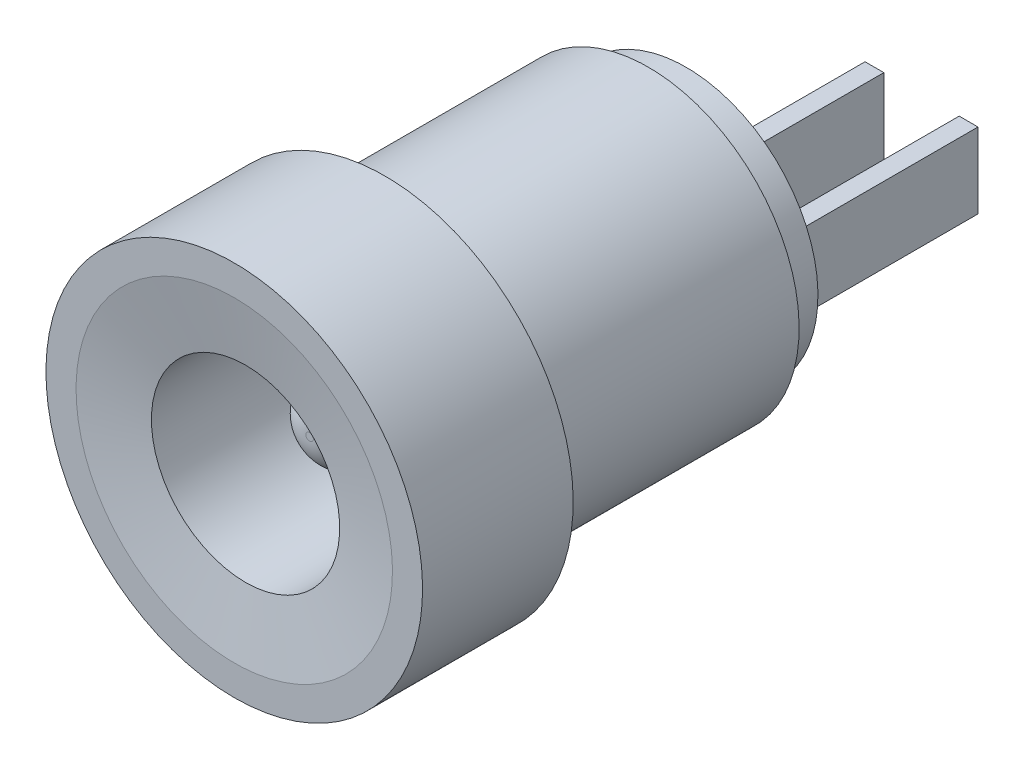
ISO-10303-21;
HEADER;
FILE_DESCRIPTION(('STEP AP214'),'2;1');
FILE_NAME('part.step','',(''),(''),'','','');
FILE_SCHEMA(('AUTOMOTIVE_DESIGN { 1 0 10303 214 1 1 1 1 }'));
ENDSEC;
DATA;
#1=APPLICATION_CONTEXT('core data for automotive mechanical design processes');
#2=APPLICATION_PROTOCOL_DEFINITION('international standard','automotive_design',2000,#1);
#3=PRODUCT_CONTEXT('',#1,'mechanical');
#4=PRODUCT('Part','Part','',(#3));
#5=PRODUCT_RELATED_PRODUCT_CATEGORY('part','',(#4));
#6=PRODUCT_DEFINITION_FORMATION('','',#4);
#7=PRODUCT_DEFINITION_CONTEXT('part definition',#1,'design');
#8=PRODUCT_DEFINITION('design','',#6,#7);
#9=PRODUCT_DEFINITION_SHAPE('','',#8);
#10=(LENGTH_UNIT() NAMED_UNIT(*) SI_UNIT(.MILLI.,.METRE.));
#11=(NAMED_UNIT(*) PLANE_ANGLE_UNIT() SI_UNIT($,.RADIAN.));
#12=(NAMED_UNIT(*) SI_UNIT($,.STERADIAN.) SOLID_ANGLE_UNIT());
#13=UNCERTAINTY_MEASURE_WITH_UNIT(LENGTH_MEASURE(1.E-05),#10,'distance_accuracy_value','');
#14=(GEOMETRIC_REPRESENTATION_CONTEXT(3) GLOBAL_UNCERTAINTY_ASSIGNED_CONTEXT((#13)) GLOBAL_UNIT_ASSIGNED_CONTEXT((#10,
#11,#12)) REPRESENTATION_CONTEXT('',''));
#15=CARTESIAN_POINT('',(0.,0.,0.));
#16=DIRECTION('',(0.,0.,1.));
#17=DIRECTION('',(1.,0.,0.));
#18=AXIS2_PLACEMENT_3D('',#15,#16,#17);
#19=CARTESIAN_POINT('',(0.,0.,-12.));
#20=DIRECTION('',(0.,0.,1.));
#21=DIRECTION('',(0.,-1.,0.));
#22=AXIS2_PLACEMENT_3D('',#19,#20,#21);
#23=PLANE('',#22);
#24=DIRECTION('',(0.,-1.,0.));
#25=VECTOR('',#24,1.);
#26=CARTESIAN_POINT('',(2.75,1.,-12.));
#27=LINE('',#26,#25);
#28=CARTESIAN_POINT('',(2.75,1.,-12.));
#29=VERTEX_POINT('',#28);
#30=CARTESIAN_POINT('',(2.75,-1.,-12.));
#31=VERTEX_POINT('',#30);
#32=EDGE_CURVE('E125',#29,#31,#27,.T.);
#33=ORIENTED_EDGE('',*,*,#32,.F.);
#34=DIRECTION('',(1.,0.,0.));
#35=VECTOR('',#34,1.);
#36=CARTESIAN_POINT('',(2.75,1.,-12.));
#37=LINE('',#36,#35);
#38=CARTESIAN_POINT('',(2.25,1.,-12.));
#39=VERTEX_POINT('',#38);
#40=EDGE_CURVE('E138',#39,#29,#37,.T.);
#41=ORIENTED_EDGE('',*,*,#40,.F.);
#42=DIRECTION('',(0.,1.,0.));
#43=VECTOR('',#42,1.);
#44=CARTESIAN_POINT('',(2.25,1.,-12.));
#45=LINE('',#44,#43);
#46=CARTESIAN_POINT('',(2.25,-1.,-12.));
#47=VERTEX_POINT('',#46);
#48=EDGE_CURVE('E147',#47,#39,#45,.T.);
#49=ORIENTED_EDGE('',*,*,#48,.F.);
#50=DIRECTION('',(-1.,0.,0.));
#51=VECTOR('',#50,1.);
#52=CARTESIAN_POINT('',(2.75,-1.,-12.));
#53=LINE('',#52,#51);
#54=EDGE_CURVE('E128',#31,#47,#53,.T.);
#55=ORIENTED_EDGE('',*,*,#54,.F.);
#56=EDGE_LOOP('',(#33,#41,#49,#55));
#57=FACE_BOUND('',#56,.T.);
#58=CARTESIAN_POINT('',(0.,0.,-12.));
#59=DIRECTION('',(0.,0.,1.));
#60=DIRECTION('',(0.,-1.,0.));
#61=AXIS2_PLACEMENT_3D('',#58,#59,#60);
#62=CIRCLE('',#61,3.5);
#63=CARTESIAN_POINT('',(0.,-3.5,-12.));
#64=VERTEX_POINT('',#63);
#65=EDGE_CURVE('E187',#64,#64,#62,.T.);
#66=ORIENTED_EDGE('',*,*,#65,.F.);
#67=EDGE_LOOP('',(#66));
#68=FACE_BOUND('',#67,.T.);
#69=DIRECTION('',(0.,-1.,0.));
#70=VECTOR('',#69,1.);
#71=CARTESIAN_POINT('',(0.25,1.,-12.));
#72=LINE('',#71,#70);
#73=CARTESIAN_POINT('',(0.25,1.,-12.));
#74=VERTEX_POINT('',#73);
#75=CARTESIAN_POINT('',(0.25,-1.,-12.));
#76=VERTEX_POINT('',#75);
#77=EDGE_CURVE('E124',#74,#76,#72,.T.);
#78=ORIENTED_EDGE('',*,*,#77,.F.);
#79=DIRECTION('',(1.,0.,0.));
#80=VECTOR('',#79,1.);
#81=CARTESIAN_POINT('',(0.25,1.,-12.));
#82=LINE('',#81,#80);
#83=CARTESIAN_POINT('',(-0.25,1.,-12.));
#84=VERTEX_POINT('',#83);
#85=EDGE_CURVE('E121',#84,#74,#82,.T.);
#86=ORIENTED_EDGE('',*,*,#85,.F.);
#87=DIRECTION('',(0.,1.,0.));
#88=VECTOR('',#87,1.);
#89=CARTESIAN_POINT('',(-0.25,1.,-12.));
#90=LINE('',#89,#88);
#91=CARTESIAN_POINT('',(-0.25,-1.,-12.));
#92=VERTEX_POINT('',#91);
#93=EDGE_CURVE('E59',#92,#84,#90,.T.);
#94=ORIENTED_EDGE('',*,*,#93,.F.);
#95=DIRECTION('',(-1.,0.,0.));
#96=VECTOR('',#95,1.);
#97=CARTESIAN_POINT('',(0.25,-1.,-12.));
#98=LINE('',#97,#96);
#99=EDGE_CURVE('E54',#76,#92,#98,.T.);
#100=ORIENTED_EDGE('',*,*,#99,.F.);
#101=EDGE_LOOP('',(#78,#86,#94,#100));
#102=FACE_BOUND('',#101,.T.);
#103=ADVANCED_FACE('F39',(#57,#68,#102),#23,.F.);
#104=CARTESIAN_POINT('',(0.,0.,-3.));
#105=DIRECTION('',(0.,0.,-1.));
#106=DIRECTION('',(0.,1.,0.));
#107=AXIS2_PLACEMENT_3D('',#104,#105,#106);
#108=DEGENERATE_TOROIDAL_SURFACE('',#107,0.1,1.,.T.);
#109=CARTESIAN_POINT('',(0.,0.,-3.));
#110=DIRECTION('',(0.,0.,-1.));
#111=DIRECTION('',(0.,1.,0.));
#112=AXIS2_PLACEMENT_3D('',#109,#110,#111);
#113=CIRCLE('',#112,1.1);
#114=CARTESIAN_POINT('',(0.,1.1,-3.));
#115=VERTEX_POINT('',#114);
#116=EDGE_CURVE('E191',#115,#115,#113,.T.);
#117=ORIENTED_EDGE('',*,*,#116,.F.);
#118=EDGE_LOOP('',(#117));
#119=FACE_BOUND('',#118,.T.);
#120=CARTESIAN_POINT('',(0.,0.,-2.));
#121=DIRECTION('',(0.,0.,-1.));
#122=DIRECTION('',(0.,1.,0.));
#123=AXIS2_PLACEMENT_3D('',#120,#121,#122);
#124=CIRCLE('',#123,0.1);
#125=CARTESIAN_POINT('',(0.,0.1,-2.));
#126=VERTEX_POINT('',#125);
#127=EDGE_CURVE('E194',#126,#126,#124,.F.);
#128=ORIENTED_EDGE('',*,*,#127,.F.);
#129=EDGE_LOOP('',(#128));
#130=FACE_BOUND('',#129,.T.);
#131=ADVANCED_FACE('F218',(#119,#130),#108,.T.);
#132=CARTESIAN_POINT('',(0.,0.,23.6977848270715));
#133=DIRECTION('',(0.,0.,1.));
#134=DIRECTION('',(0.,-1.,0.));
#135=AXIS2_PLACEMENT_3D('',#132,#133,#134);
#136=CYLINDRICAL_SURFACE('',#135,3.5);
#137=CARTESIAN_POINT('',(0.,0.,-11.));
#138=DIRECTION('',(0.,0.,1.));
#139=DIRECTION('',(0.,-1.,0.));
#140=AXIS2_PLACEMENT_3D('',#137,#138,#139);
#141=CIRCLE('',#140,3.5);
#142=CARTESIAN_POINT('',(0.,-3.5,-11.));
#143=VERTEX_POINT('',#142);
#144=EDGE_CURVE('E183',#143,#143,#141,.T.);
#145=ORIENTED_EDGE('',*,*,#144,.F.);
#146=EDGE_LOOP('',(#145));
#147=FACE_BOUND('',#146,.T.);
#148=ORIENTED_EDGE('',*,*,#65,.T.);
#149=EDGE_LOOP('',(#148));
#150=FACE_BOUND('',#149,.T.);
#151=ADVANCED_FACE('F224',(#147,#150),#136,.T.);
#152=CARTESIAN_POINT('',(0.,3.5,-11.));
#153=DIRECTION('',(0.,0.,1.));
#154=DIRECTION('',(0.,-1.,0.));
#155=AXIS2_PLACEMENT_3D('',#152,#153,#154);
#156=PLANE('',#155);
#157=CARTESIAN_POINT('',(0.,0.,-11.));
#158=DIRECTION('',(0.,0.,1.));
#159=DIRECTION('',(0.,-1.,0.));
#160=AXIS2_PLACEMENT_3D('',#157,#158,#159);
#161=CIRCLE('',#160,4.);
#162=CARTESIAN_POINT('',(0.,-4.,-11.));
#163=VERTEX_POINT('',#162);
#164=EDGE_CURVE('E179',#163,#163,#161,.T.);
#165=ORIENTED_EDGE('',*,*,#164,.F.);
#166=EDGE_LOOP('',(#165));
#167=FACE_BOUND('',#166,.T.);
#168=ORIENTED_EDGE('',*,*,#144,.T.);
#169=EDGE_LOOP('',(#168));
#170=FACE_BOUND('',#169,.T.);
#171=ADVANCED_FACE('F230',(#167,#170),#156,.F.);
#172=CARTESIAN_POINT('',(0.,0.,23.6977848270715));
#173=DIRECTION('',(0.,0.,1.));
#174=DIRECTION('',(0.,-1.,0.));
#175=AXIS2_PLACEMENT_3D('',#172,#173,#174);
#176=CYLINDRICAL_SURFACE('',#175,4.);
#177=CARTESIAN_POINT('',(0.,0.,-4.));
#178=DIRECTION('',(0.,0.,1.));
#179=DIRECTION('',(0.,-1.,0.));
#180=AXIS2_PLACEMENT_3D('',#177,#178,#179);
#181=CIRCLE('',#180,4.);
#182=CARTESIAN_POINT('',(0.,-4.,-4.));
#183=VERTEX_POINT('',#182);
#184=EDGE_CURVE('E176',#183,#183,#181,.T.);
#185=ORIENTED_EDGE('',*,*,#184,.F.);
#186=EDGE_LOOP('',(#185));
#187=FACE_BOUND('',#186,.T.);
#188=ORIENTED_EDGE('',*,*,#164,.T.);
#189=EDGE_LOOP('',(#188));
#190=FACE_BOUND('',#189,.T.);
#191=ADVANCED_FACE('F234',(#187,#190),#176,.T.);
#192=CARTESIAN_POINT('',(0.,4.,-4.));
#193=DIRECTION('',(0.,0.,1.));
#194=DIRECTION('',(0.,-1.,0.));
#195=AXIS2_PLACEMENT_3D('',#192,#193,#194);
#196=PLANE('',#195);
#197=CARTESIAN_POINT('',(0.,0.,-4.));
#198=DIRECTION('',(0.,0.,1.));
#199=DIRECTION('',(0.,-1.,0.));
#200=AXIS2_PLACEMENT_3D('',#197,#198,#199);
#201=CIRCLE('',#200,5.);
#202=CARTESIAN_POINT('',(0.,-5.,-4.));
#203=VERTEX_POINT('',#202);
#204=EDGE_CURVE('E173',#203,#203,#201,.T.);
#205=ORIENTED_EDGE('',*,*,#204,.F.);
#206=EDGE_LOOP('',(#205));
#207=FACE_BOUND('',#206,.T.);
#208=ORIENTED_EDGE('',*,*,#184,.T.);
#209=EDGE_LOOP('',(#208));
#210=FACE_BOUND('',#209,.T.);
#211=ADVANCED_FACE('F238',(#207,#210),#196,.F.);
#212=CARTESIAN_POINT('',(0.,0.,23.6977848270715));
#213=DIRECTION('',(0.,0.,1.));
#214=DIRECTION('',(0.,-1.,0.));
#215=AXIS2_PLACEMENT_3D('',#212,#213,#214);
#216=CYLINDRICAL_SURFACE('',#215,5.);
#217=CARTESIAN_POINT('',(0.,0.,0.));
#218=DIRECTION('',(0.,0.,1.));
#219=DIRECTION('',(0.,-1.,0.));
#220=AXIS2_PLACEMENT_3D('',#217,#218,#219);
#221=CIRCLE('',#220,5.);
#222=CARTESIAN_POINT('',(0.,-5.,0.));
#223=VERTEX_POINT('',#222);
#224=EDGE_CURVE('E170',#223,#223,#221,.T.);
#225=ORIENTED_EDGE('',*,*,#224,.F.);
#226=EDGE_LOOP('',(#225));
#227=FACE_BOUND('',#226,.T.);
#228=ORIENTED_EDGE('',*,*,#204,.T.);
#229=EDGE_LOOP('',(#228));
#230=FACE_BOUND('',#229,.T.);
#231=ADVANCED_FACE('F242',(#227,#230),#216,.T.);
#232=CARTESIAN_POINT('',(0.,5.,0.));
#233=DIRECTION('',(0.,0.,-1.));
#234=DIRECTION('',(0.,1.,0.));
#235=AXIS2_PLACEMENT_3D('',#232,#233,#234);
#236=PLANE('',#235);
#237=CARTESIAN_POINT('',(0.,0.,0.));
#238=DIRECTION('',(0.,0.,-1.));
#239=DIRECTION('',(0.,1.,0.));
#240=AXIS2_PLACEMENT_3D('',#237,#238,#239);
#241=CIRCLE('',#240,4.20138454588531);
#242=CARTESIAN_POINT('',(0.,4.20138454588531,0.));
#243=VERTEX_POINT('',#242);
#244=EDGE_CURVE('E11',#243,#243,#241,.T.);
#245=ORIENTED_EDGE('',*,*,#244,.T.);
#246=EDGE_LOOP('',(#245));
#247=FACE_BOUND('',#246,.T.);
#248=ORIENTED_EDGE('',*,*,#224,.T.);
#249=EDGE_LOOP('',(#248));
#250=FACE_BOUND('',#249,.T.);
#251=ADVANCED_FACE('F246',(#247,#250),#236,.F.);
#252=CARTESIAN_POINT('',(0.,0.,23.6977848270715));
#253=DIRECTION('',(0.,0.,1.));
#254=DIRECTION('',(0.,-1.,0.));
#255=AXIS2_PLACEMENT_3D('',#252,#253,#254);
#256=CYLINDRICAL_SURFACE('',#255,2.5);
#257=CARTESIAN_POINT('',(0.,0.,-0.300000000000002));
#258=DIRECTION('',(0.,0.,-1.));
#259=DIRECTION('',(0.,1.,0.));
#260=AXIS2_PLACEMENT_3D('',#257,#258,#259);
#261=CIRCLE('',#260,2.5);
#262=CARTESIAN_POINT('',(0.,2.5,-0.300000000000002));
#263=VERTEX_POINT('',#262);
#264=EDGE_CURVE('E47',#263,#263,#261,.F.);
#265=ORIENTED_EDGE('',*,*,#264,.T.);
#266=EDGE_LOOP('',(#265));
#267=FACE_BOUND('',#266,.T.);
#268=CARTESIAN_POINT('',(0.,0.,-8.));
#269=DIRECTION('',(0.,0.,1.));
#270=DIRECTION('',(0.,-1.,0.));
#271=AXIS2_PLACEMENT_3D('',#268,#269,#270);
#272=CIRCLE('',#271,2.5);
#273=CARTESIAN_POINT('',(0.,-2.5,-8.));
#274=VERTEX_POINT('',#273);
#275=EDGE_CURVE('E166',#274,#274,#272,.T.);
#276=ORIENTED_EDGE('',*,*,#275,.F.);
#277=EDGE_LOOP('',(#276));
#278=FACE_BOUND('',#277,.T.);
#279=ADVANCED_FACE('F199',(#267,#278),#256,.F.);
#280=CARTESIAN_POINT('',(0.,2.5,-8.));
#281=DIRECTION('',(0.,0.,-1.));
#282=DIRECTION('',(0.,1.,0.));
#283=AXIS2_PLACEMENT_3D('',#280,#281,#282);
#284=PLANE('',#283);
#285=CARTESIAN_POINT('',(0.,0.,-8.));
#286=DIRECTION('',(0.,0.,1.));
#287=DIRECTION('',(0.,-1.,0.));
#288=AXIS2_PLACEMENT_3D('',#285,#286,#287);
#289=CIRCLE('',#288,1.1);
#290=CARTESIAN_POINT('',(0.,-1.1,-8.));
#291=VERTEX_POINT('',#290);
#292=EDGE_CURVE('E163',#291,#291,#289,.T.);
#293=ORIENTED_EDGE('',*,*,#292,.F.);
#294=EDGE_LOOP('',(#293));
#295=FACE_BOUND('',#294,.T.);
#296=ORIENTED_EDGE('',*,*,#275,.T.);
#297=EDGE_LOOP('',(#296));
#298=FACE_BOUND('',#297,.T.);
#299=ADVANCED_FACE('F253',(#295,#298),#284,.F.);
#300=CARTESIAN_POINT('',(0.,0.,23.6977848270715));
#301=DIRECTION('',(0.,0.,1.));
#302=DIRECTION('',(0.,-1.,0.));
#303=AXIS2_PLACEMENT_3D('',#300,#301,#302);
#304=CYLINDRICAL_SURFACE('',#303,1.1);
#305=ORIENTED_EDGE('',*,*,#116,.T.);
#306=EDGE_LOOP('',(#305));
#307=FACE_BOUND('',#306,.T.);
#308=ORIENTED_EDGE('',*,*,#292,.T.);
#309=EDGE_LOOP('',(#308));
#310=FACE_BOUND('',#309,.T.);
#311=ADVANCED_FACE('F213',(#307,#310),#304,.T.);
#312=CARTESIAN_POINT('',(0.,1.1,-2.));
#313=DIRECTION('',(0.,0.,-1.));
#314=DIRECTION('',(0.,1.,0.));
#315=AXIS2_PLACEMENT_3D('',#312,#313,#314);
#316=PLANE('',#315);
#317=ORIENTED_EDGE('',*,*,#127,.T.);
#318=EDGE_LOOP('',(#317));
#319=FACE_BOUND('',#318,.T.);
#320=ADVANCED_FACE('F204',(#319),#316,.F.);
#321=CARTESIAN_POINT('',(0.,0.,-0.300000000000002));
#322=DIRECTION('',(0.,0.,1.));
#323=DIRECTION('',(0.,-1.,0.));
#324=AXIS2_PLACEMENT_3D('',#321,#322,#323);
#325=CONICAL_SURFACE('',#324,2.5,1.39626340159546);
#326=ORIENTED_EDGE('',*,*,#244,.F.);
#327=EDGE_LOOP('',(#326));
#328=FACE_BOUND('',#327,.T.);
#329=ORIENTED_EDGE('',*,*,#264,.F.);
#330=EDGE_LOOP('',(#329));
#331=FACE_BOUND('',#330,.T.);
#332=ADVANCED_FACE('F41',(#328,#331),#325,.F.);
#333=CARTESIAN_POINT('',(2.75,1.,-17.));
#334=DIRECTION('',(-1.,0.,0.));
#335=DIRECTION('',(0.,0.,1.));
#336=AXIS2_PLACEMENT_3D('',#333,#334,#335);
#337=PLANE('',#336);
#338=ORIENTED_EDGE('',*,*,#32,.T.);
#339=DIRECTION('',(0.,0.,1.));
#340=VECTOR('',#339,1.);
#341=CARTESIAN_POINT('',(2.75,-1.,-17.));
#342=LINE('',#341,#340);
#343=CARTESIAN_POINT('',(2.75,-1.,-17.));
#344=VERTEX_POINT('',#343);
#345=EDGE_CURVE('E160',#344,#31,#342,.T.);
#346=ORIENTED_EDGE('',*,*,#345,.F.);
#347=DIRECTION('',(0.,-1.,0.));
#348=VECTOR('',#347,1.);
#349=CARTESIAN_POINT('',(2.75,1.,-17.));
#350=LINE('',#349,#348);
#351=CARTESIAN_POINT('',(2.75,1.,-17.));
#352=VERTEX_POINT('',#351);
#353=EDGE_CURVE('E134',#352,#344,#350,.T.);
#354=ORIENTED_EDGE('',*,*,#353,.F.);
#355=DIRECTION('',(0.,0.,1.));
#356=VECTOR('',#355,1.);
#357=CARTESIAN_POINT('',(2.75,1.,-17.));
#358=LINE('',#357,#356);
#359=EDGE_CURVE('E143',#352,#29,#358,.T.);
#360=ORIENTED_EDGE('',*,*,#359,.T.);
#361=EDGE_LOOP('',(#338,#346,#354,#360));
#362=FACE_BOUND('',#361,.T.);
#363=ADVANCED_FACE('F203',(#362),#337,.F.);
#364=CARTESIAN_POINT('',(2.75,-1.,-17.));
#365=DIRECTION('',(0.,1.,0.));
#366=DIRECTION('',(0.,0.,1.));
#367=AXIS2_PLACEMENT_3D('',#364,#365,#366);
#368=PLANE('',#367);
#369=ORIENTED_EDGE('',*,*,#54,.T.);
#370=DIRECTION('',(0.,0.,1.));
#371=VECTOR('',#370,1.);
#372=CARTESIAN_POINT('',(2.25,-1.,-17.));
#373=LINE('',#372,#371);
#374=CARTESIAN_POINT('',(2.25,-1.,-17.));
#375=VERTEX_POINT('',#374);
#376=EDGE_CURVE('E157',#375,#47,#373,.T.);
#377=ORIENTED_EDGE('',*,*,#376,.F.);
#378=DIRECTION('',(-1.,0.,0.));
#379=VECTOR('',#378,1.);
#380=CARTESIAN_POINT('',(2.75,-1.,-17.));
#381=LINE('',#380,#379);
#382=EDGE_CURVE('E137',#344,#375,#381,.T.);
#383=ORIENTED_EDGE('',*,*,#382,.F.);
#384=ORIENTED_EDGE('',*,*,#345,.T.);
#385=EDGE_LOOP('',(#369,#377,#383,#384));
#386=FACE_BOUND('',#385,.T.);
#387=ADVANCED_FACE('F210',(#386),#368,.F.);
#388=CARTESIAN_POINT('',(2.25,1.,-17.));
#389=DIRECTION('',(1.,0.,0.));
#390=DIRECTION('',(0.,0.,-1.));
#391=AXIS2_PLACEMENT_3D('',#388,#389,#390);
#392=PLANE('',#391);
#393=ORIENTED_EDGE('',*,*,#48,.T.);
#394=DIRECTION('',(0.,0.,1.));
#395=VECTOR('',#394,1.);
#396=CARTESIAN_POINT('',(2.25,1.,-17.));
#397=LINE('',#396,#395);
#398=CARTESIAN_POINT('',(2.25,1.,-17.));
#399=VERTEX_POINT('',#398);
#400=EDGE_CURVE('E154',#399,#39,#397,.T.);
#401=ORIENTED_EDGE('',*,*,#400,.F.);
#402=DIRECTION('',(0.,1.,0.));
#403=VECTOR('',#402,1.);
#404=CARTESIAN_POINT('',(2.25,1.,-17.));
#405=LINE('',#404,#403);
#406=EDGE_CURVE('E140',#375,#399,#405,.T.);
#407=ORIENTED_EDGE('',*,*,#406,.F.);
#408=ORIENTED_EDGE('',*,*,#376,.T.);
#409=EDGE_LOOP('',(#393,#401,#407,#408));
#410=FACE_BOUND('',#409,.T.);
#411=ADVANCED_FACE('F262',(#410),#392,.F.);
#412=CARTESIAN_POINT('',(2.75,1.,-17.));
#413=DIRECTION('',(0.,-1.,0.));
#414=DIRECTION('',(0.,0.,-1.));
#415=AXIS2_PLACEMENT_3D('',#412,#413,#414);
#416=PLANE('',#415);
#417=ORIENTED_EDGE('',*,*,#40,.T.);
#418=ORIENTED_EDGE('',*,*,#359,.F.);
#419=DIRECTION('',(1.,0.,0.));
#420=VECTOR('',#419,1.);
#421=CARTESIAN_POINT('',(2.75,1.,-17.));
#422=LINE('',#421,#420);
#423=EDGE_CURVE('E142',#399,#352,#422,.T.);
#424=ORIENTED_EDGE('',*,*,#423,.F.);
#425=ORIENTED_EDGE('',*,*,#400,.T.);
#426=EDGE_LOOP('',(#417,#418,#424,#425));
#427=FACE_BOUND('',#426,.T.);
#428=ADVANCED_FACE('F266',(#427),#416,.F.);
#429=CARTESIAN_POINT('',(0.,0.,-17.));
#430=DIRECTION('',(0.,0.,-1.));
#431=DIRECTION('',(-1.,0.,0.));
#432=AXIS2_PLACEMENT_3D('',#429,#430,#431);
#433=PLANE('',#432);
#434=ORIENTED_EDGE('',*,*,#353,.T.);
#435=ORIENTED_EDGE('',*,*,#382,.T.);
#436=ORIENTED_EDGE('',*,*,#406,.T.);
#437=ORIENTED_EDGE('',*,*,#423,.T.);
#438=EDGE_LOOP('',(#434,#435,#436,#437));
#439=FACE_BOUND('',#438,.T.);
#440=ADVANCED_FACE('F270',(#439),#433,.T.);
#441=CARTESIAN_POINT('',(0.25,1.,-17.));
#442=DIRECTION('',(-1.,0.,0.));
#443=DIRECTION('',(0.,-1.,0.));
#444=AXIS2_PLACEMENT_3D('',#441,#442,#443);
#445=PLANE('',#444);
#446=ORIENTED_EDGE('',*,*,#77,.T.);
#447=DIRECTION('',(0.,0.,1.));
#448=VECTOR('',#447,1.);
#449=CARTESIAN_POINT('',(0.25,-1.,-17.));
#450=LINE('',#449,#448);
#451=CARTESIAN_POINT('',(0.25,-1.,-17.));
#452=VERTEX_POINT('',#451);
#453=EDGE_CURVE('E105',#452,#76,#450,.T.);
#454=ORIENTED_EDGE('',*,*,#453,.F.);
#455=DIRECTION('',(0.,-1.,0.));
#456=VECTOR('',#455,1.);
#457=CARTESIAN_POINT('',(0.25,1.,-17.));
#458=LINE('',#457,#456);
#459=CARTESIAN_POINT('',(0.25,1.,-17.));
#460=VERTEX_POINT('',#459);
#461=EDGE_CURVE('E112',#460,#452,#458,.T.);
#462=ORIENTED_EDGE('',*,*,#461,.F.);
#463=DIRECTION('',(0.,0.,1.));
#464=VECTOR('',#463,1.);
#465=CARTESIAN_POINT('',(0.25,1.,-17.));
#466=LINE('',#465,#464);
#467=EDGE_CURVE('E434',#460,#74,#466,.T.);
#468=ORIENTED_EDGE('',*,*,#467,.T.);
#469=EDGE_LOOP('',(#446,#454,#462,#468));
#470=FACE_BOUND('',#469,.T.);
#471=ADVANCED_FACE('F123',(#470),#445,.F.);
#472=CARTESIAN_POINT('',(0.25,-1.,-17.));
#473=DIRECTION('',(0.,1.,0.));
#474=DIRECTION('',(0.,0.,1.));
#475=AXIS2_PLACEMENT_3D('',#472,#473,#474);
#476=PLANE('',#475);
#477=ORIENTED_EDGE('',*,*,#99,.T.);
#478=DIRECTION('',(0.,0.,1.));
#479=VECTOR('',#478,1.);
#480=CARTESIAN_POINT('',(-0.25,-1.,-17.));
#481=LINE('',#480,#479);
#482=CARTESIAN_POINT('',(-0.25,-1.,-17.));
#483=VERTEX_POINT('',#482);
#484=EDGE_CURVE('E108',#483,#92,#481,.T.);
#485=ORIENTED_EDGE('',*,*,#484,.F.);
#486=DIRECTION('',(-1.,0.,0.));
#487=VECTOR('',#486,1.);
#488=CARTESIAN_POINT('',(0.25,-1.,-17.));
#489=LINE('',#488,#487);
#490=EDGE_CURVE('E101',#452,#483,#489,.T.);
#491=ORIENTED_EDGE('',*,*,#490,.F.);
#492=ORIENTED_EDGE('',*,*,#453,.T.);
#493=EDGE_LOOP('',(#477,#485,#491,#492));
#494=FACE_BOUND('',#493,.T.);
#495=ADVANCED_FACE('F103',(#494),#476,.F.);
#496=CARTESIAN_POINT('',(-0.25,1.,-17.));
#497=DIRECTION('',(1.,0.,0.));
#498=DIRECTION('',(0.,1.,0.));
#499=AXIS2_PLACEMENT_3D('',#496,#497,#498);
#500=PLANE('',#499);
#501=ORIENTED_EDGE('',*,*,#93,.T.);
#502=DIRECTION('',(0.,0.,1.));
#503=VECTOR('',#502,1.);
#504=CARTESIAN_POINT('',(-0.25,1.,-17.));
#505=LINE('',#504,#503);
#506=CARTESIAN_POINT('',(-0.25,1.,-17.));
#507=VERTEX_POINT('',#506);
#508=EDGE_CURVE('E130',#507,#84,#505,.T.);
#509=ORIENTED_EDGE('',*,*,#508,.F.);
#510=DIRECTION('',(0.,1.,0.));
#511=VECTOR('',#510,1.);
#512=CARTESIAN_POINT('',(-0.25,1.,-17.));
#513=LINE('',#512,#511);
#514=EDGE_CURVE('E111',#483,#507,#513,.T.);
#515=ORIENTED_EDGE('',*,*,#514,.F.);
#516=ORIENTED_EDGE('',*,*,#484,.T.);
#517=EDGE_LOOP('',(#501,#509,#515,#516));
#518=FACE_BOUND('',#517,.T.);
#519=ADVANCED_FACE('F279',(#518),#500,.F.);
#520=CARTESIAN_POINT('',(0.25,1.,-17.));
#521=DIRECTION('',(0.,-1.,0.));
#522=DIRECTION('',(0.,0.,-1.));
#523=AXIS2_PLACEMENT_3D('',#520,#521,#522);
#524=PLANE('',#523);
#525=ORIENTED_EDGE('',*,*,#85,.T.);
#526=ORIENTED_EDGE('',*,*,#467,.F.);
#527=DIRECTION('',(1.,0.,0.));
#528=VECTOR('',#527,1.);
#529=CARTESIAN_POINT('',(0.25,1.,-17.));
#530=LINE('',#529,#528);
#531=EDGE_CURVE('E117',#507,#460,#530,.T.);
#532=ORIENTED_EDGE('',*,*,#531,.F.);
#533=ORIENTED_EDGE('',*,*,#508,.T.);
#534=EDGE_LOOP('',(#525,#526,#532,#533));
#535=FACE_BOUND('',#534,.T.);
#536=ADVANCED_FACE('F282',(#535),#524,.F.);
#537=CARTESIAN_POINT('',(0.,0.,-17.));
#538=DIRECTION('',(0.,0.,-1.));
#539=DIRECTION('',(-1.,0.,0.));
#540=AXIS2_PLACEMENT_3D('',#537,#538,#539);
#541=PLANE('',#540);
#542=ORIENTED_EDGE('',*,*,#461,.T.);
#543=ORIENTED_EDGE('',*,*,#490,.T.);
#544=ORIENTED_EDGE('',*,*,#514,.T.);
#545=ORIENTED_EDGE('',*,*,#531,.T.);
#546=EDGE_LOOP('',(#542,#543,#544,#545));
#547=FACE_BOUND('',#546,.T.);
#548=ADVANCED_FACE('F115',(#547),#541,.T.);
#549=CLOSED_SHELL('',(#103,#131,#151,#171,#191,#211,#231,#251,#279,#299,#311,#320,#332,#363,
#387,#411,#428,#440,#471,#495,#519,#536,#548));
#550=MANIFOLD_SOLID_BREP('B2',#549);
#551=ADVANCED_BREP_SHAPE_REPRESENTATION('',(#18,#550),#14);
#552=SHAPE_DEFINITION_REPRESENTATION(#9,#551);
ENDSEC;
END-ISO-10303-21;
